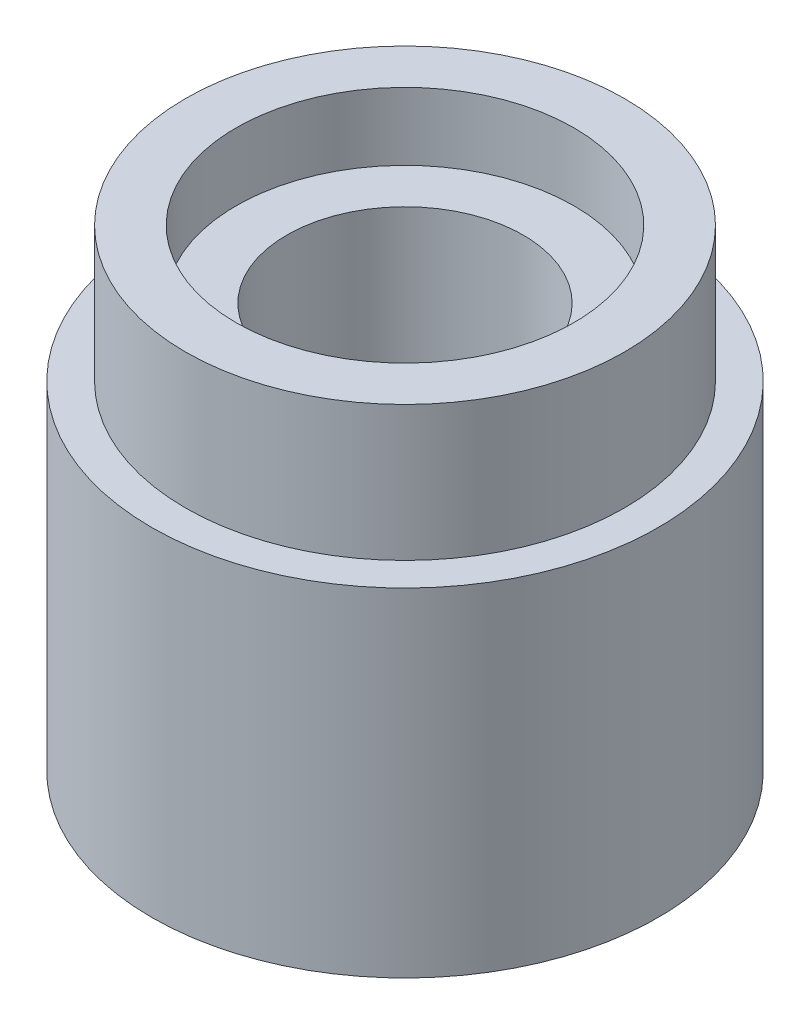
ISO-10303-21;
HEADER;
FILE_DESCRIPTION(('STEP AP214'),'2;1');
FILE_NAME('part.step','',(''),(''),'','','');
FILE_SCHEMA(('AUTOMOTIVE_DESIGN { 1 0 10303 214 1 1 1 1 }'));
ENDSEC;
DATA;
#1=APPLICATION_CONTEXT('core data for automotive mechanical design processes');
#2=APPLICATION_PROTOCOL_DEFINITION('international standard','automotive_design',2000,#1);
#3=PRODUCT_CONTEXT('',#1,'mechanical');
#4=PRODUCT('Part','Part','',(#3));
#5=PRODUCT_RELATED_PRODUCT_CATEGORY('part','',(#4));
#6=PRODUCT_DEFINITION_FORMATION('','',#4);
#7=PRODUCT_DEFINITION_CONTEXT('part definition',#1,'design');
#8=PRODUCT_DEFINITION('design','',#6,#7);
#9=PRODUCT_DEFINITION_SHAPE('','',#8);
#10=(LENGTH_UNIT() NAMED_UNIT(*) SI_UNIT(.MILLI.,.METRE.));
#11=(NAMED_UNIT(*) PLANE_ANGLE_UNIT() SI_UNIT($,.RADIAN.));
#12=(NAMED_UNIT(*) SI_UNIT($,.STERADIAN.) SOLID_ANGLE_UNIT());
#13=UNCERTAINTY_MEASURE_WITH_UNIT(LENGTH_MEASURE(1.E-05),#10,'distance_accuracy_value','');
#14=(GEOMETRIC_REPRESENTATION_CONTEXT(3) GLOBAL_UNCERTAINTY_ASSIGNED_CONTEXT((#13)) GLOBAL_UNIT_ASSIGNED_CONTEXT((#10,
#11,#12)) REPRESENTATION_CONTEXT('',''));
#15=CARTESIAN_POINT('',(0.,0.,0.));
#16=DIRECTION('',(0.,0.,1.));
#17=DIRECTION('',(1.,0.,0.));
#18=AXIS2_PLACEMENT_3D('',#15,#16,#17);
#19=CARTESIAN_POINT('',(0.,7.,0.));
#20=DIRECTION('',(0.,-1.,0.));
#21=DIRECTION('',(0.,0.,-1.));
#22=AXIS2_PLACEMENT_3D('',#19,#20,#21);
#23=CYLINDRICAL_SURFACE('',#22,3.75);
#24=CARTESIAN_POINT('',(0.,0.,0.));
#25=DIRECTION('',(0.,1.,0.));
#26=DIRECTION('',(0.,0.,1.));
#27=AXIS2_PLACEMENT_3D('',#24,#25,#26);
#28=CIRCLE('',#27,3.75);
#29=CARTESIAN_POINT('',(0.,0.,3.75));
#30=VERTEX_POINT('',#29);
#31=EDGE_CURVE('E10',#30,#30,#28,.T.);
#32=ORIENTED_EDGE('',*,*,#31,.T.);
#33=EDGE_LOOP('',(#32));
#34=FACE_BOUND('',#33,.T.);
#35=CARTESIAN_POINT('',(0.,5.,0.));
#36=DIRECTION('',(0.,1.,0.));
#37=DIRECTION('',(0.,0.,1.));
#38=AXIS2_PLACEMENT_3D('',#35,#36,#37);
#39=CIRCLE('',#38,3.75);
#40=CARTESIAN_POINT('',(0.,5.,3.75));
#41=VERTEX_POINT('',#40);
#42=EDGE_CURVE('E44',#41,#41,#39,.T.);
#43=ORIENTED_EDGE('',*,*,#42,.F.);
#44=EDGE_LOOP('',(#43));
#45=FACE_BOUND('',#44,.T.);
#46=ADVANCED_FACE('F36',(#34,#45),#23,.T.);
#47=CARTESIAN_POINT('',(0.,0.,0.));
#48=DIRECTION('',(0.,1.,0.));
#49=DIRECTION('',(0.,0.,1.));
#50=AXIS2_PLACEMENT_3D('',#47,#48,#49);
#51=PLANE('',#50);
#52=ORIENTED_EDGE('',*,*,#31,.F.);
#53=EDGE_LOOP('',(#52));
#54=FACE_BOUND('',#53,.T.);
#55=ADVANCED_FACE('F92',(#54),#51,.F.);
#56=CARTESIAN_POINT('',(0.,5.,0.));
#57=DIRECTION('',(0.,1.,0.));
#58=DIRECTION('',(0.,0.,1.));
#59=AXIS2_PLACEMENT_3D('',#56,#57,#58);
#60=PLANE('',#59);
#61=CARTESIAN_POINT('',(0.,5.,0.));
#62=DIRECTION('',(0.,1.,0.));
#63=DIRECTION('',(0.,0.,1.));
#64=AXIS2_PLACEMENT_3D('',#61,#62,#63);
#65=CIRCLE('',#64,3.25);
#66=CARTESIAN_POINT('',(0.,5.,3.25));
#67=VERTEX_POINT('',#66);
#68=EDGE_CURVE('E49',#67,#67,#65,.T.);
#69=ORIENTED_EDGE('',*,*,#68,.F.);
#70=EDGE_LOOP('',(#69));
#71=FACE_BOUND('',#70,.T.);
#72=ORIENTED_EDGE('',*,*,#42,.T.);
#73=EDGE_LOOP('',(#72));
#74=FACE_BOUND('',#73,.T.);
#75=ADVANCED_FACE('F96',(#71,#74),#60,.T.);
#76=CARTESIAN_POINT('',(0.,5.,0.));
#77=DIRECTION('',(0.,1.,0.));
#78=DIRECTION('',(0.,0.,1.));
#79=AXIS2_PLACEMENT_3D('',#76,#77,#78);
#80=CYLINDRICAL_SURFACE('',#79,3.25);
#81=ORIENTED_EDGE('',*,*,#68,.T.);
#82=EDGE_LOOP('',(#81));
#83=FACE_BOUND('',#82,.T.);
#84=CARTESIAN_POINT('',(0.,7.,0.));
#85=DIRECTION('',(0.,1.,0.));
#86=DIRECTION('',(0.,0.,1.));
#87=AXIS2_PLACEMENT_3D('',#84,#85,#86);
#88=CIRCLE('',#87,3.25);
#89=CARTESIAN_POINT('',(0.,7.,3.25));
#90=VERTEX_POINT('',#89);
#91=EDGE_CURVE('E52',#90,#90,#88,.T.);
#92=ORIENTED_EDGE('',*,*,#91,.F.);
#93=EDGE_LOOP('',(#92));
#94=FACE_BOUND('',#93,.T.);
#95=ADVANCED_FACE('F102',(#83,#94),#80,.T.);
#96=CARTESIAN_POINT('',(0.,7.,0.));
#97=DIRECTION('',(0.,1.,0.));
#98=DIRECTION('',(0.,0.,1.));
#99=AXIS2_PLACEMENT_3D('',#96,#97,#98);
#100=PLANE('',#99);
#101=CARTESIAN_POINT('',(0.,7.,0.));
#102=DIRECTION('',(0.,1.,0.));
#103=DIRECTION('',(0.,0.,1.));
#104=AXIS2_PLACEMENT_3D('',#101,#102,#103);
#105=CIRCLE('',#104,2.5);
#106=CARTESIAN_POINT('',(0.,7.,2.5));
#107=VERTEX_POINT('',#106);
#108=EDGE_CURVE('E63',#107,#107,#105,.T.);
#109=ORIENTED_EDGE('',*,*,#108,.F.);
#110=EDGE_LOOP('',(#109));
#111=FACE_BOUND('',#110,.T.);
#112=ORIENTED_EDGE('',*,*,#91,.T.);
#113=EDGE_LOOP('',(#112));
#114=FACE_BOUND('',#113,.T.);
#115=ADVANCED_FACE('F108',(#111,#114),#100,.T.);
#116=CARTESIAN_POINT('',(0.,6.,0.));
#117=DIRECTION('',(0.,1.,0.));
#118=DIRECTION('',(0.,0.,1.));
#119=AXIS2_PLACEMENT_3D('',#116,#117,#118);
#120=PLANE('',#119);
#121=CARTESIAN_POINT('',(0.,6.,0.));
#122=DIRECTION('',(0.,1.,0.));
#123=DIRECTION('',(0.,0.,1.));
#124=AXIS2_PLACEMENT_3D('',#121,#122,#123);
#125=CIRCLE('',#124,2.5);
#126=CARTESIAN_POINT('',(0.,6.,2.5));
#127=VERTEX_POINT('',#126);
#128=EDGE_CURVE('E67',#127,#127,#125,.T.);
#129=ORIENTED_EDGE('',*,*,#128,.T.);
#130=EDGE_LOOP('',(#129));
#131=FACE_BOUND('',#130,.T.);
#132=CARTESIAN_POINT('',(0.,6.,0.));
#133=DIRECTION('',(0.,1.,0.));
#134=DIRECTION('',(0.,0.,1.));
#135=AXIS2_PLACEMENT_3D('',#132,#133,#134);
#136=CIRCLE('',#135,1.75);
#137=CARTESIAN_POINT('',(0.,6.,1.75));
#138=VERTEX_POINT('',#137);
#139=EDGE_CURVE('E39',#138,#138,#136,.F.);
#140=ORIENTED_EDGE('',*,*,#139,.T.);
#141=EDGE_LOOP('',(#140));
#142=FACE_BOUND('',#141,.T.);
#143=ADVANCED_FACE('F76',(#131,#142),#120,.T.);
#144=CARTESIAN_POINT('',(0.,6.,0.));
#145=DIRECTION('',(0.,1.,0.));
#146=DIRECTION('',(0.,0.,1.));
#147=AXIS2_PLACEMENT_3D('',#144,#145,#146);
#148=CYLINDRICAL_SURFACE('',#147,2.5);
#149=ORIENTED_EDGE('',*,*,#128,.F.);
#150=EDGE_LOOP('',(#149));
#151=FACE_BOUND('',#150,.T.);
#152=ORIENTED_EDGE('',*,*,#108,.T.);
#153=EDGE_LOOP('',(#152));
#154=FACE_BOUND('',#153,.T.);
#155=ADVANCED_FACE('F86',(#151,#154),#148,.F.);
#156=CARTESIAN_POINT('',(0.,0.5,0.));
#157=DIRECTION('',(0.,1.,0.));
#158=DIRECTION('',(0.,0.,1.));
#159=AXIS2_PLACEMENT_3D('',#156,#157,#158);
#160=PLANE('',#159);
#161=CARTESIAN_POINT('',(0.,0.5,0.));
#162=DIRECTION('',(0.,1.,0.));
#163=DIRECTION('',(0.,0.,1.));
#164=AXIS2_PLACEMENT_3D('',#161,#162,#163);
#165=CIRCLE('',#164,1.75);
#166=CARTESIAN_POINT('',(0.,0.5,1.75));
#167=VERTEX_POINT('',#166);
#168=EDGE_CURVE('E56',#167,#167,#165,.T.);
#169=ORIENTED_EDGE('',*,*,#168,.T.);
#170=EDGE_LOOP('',(#169));
#171=FACE_BOUND('',#170,.T.);
#172=ADVANCED_FACE('F80',(#171),#160,.T.);
#173=CARTESIAN_POINT('',(0.,0.5,0.));
#174=DIRECTION('',(0.,1.,0.));
#175=DIRECTION('',(0.,0.,1.));
#176=AXIS2_PLACEMENT_3D('',#173,#174,#175);
#177=CYLINDRICAL_SURFACE('',#176,1.75);
#178=ORIENTED_EDGE('',*,*,#168,.F.);
#179=EDGE_LOOP('',(#178));
#180=FACE_BOUND('',#179,.T.);
#181=ORIENTED_EDGE('',*,*,#139,.F.);
#182=EDGE_LOOP('',(#181));
#183=FACE_BOUND('',#182,.T.);
#184=ADVANCED_FACE('F78',(#180,#183),#177,.F.);
#185=CLOSED_SHELL('',(#46,#55,#75,#95,#115,#143,#155,#172,#184));
#186=MANIFOLD_SOLID_BREP('B2',#185);
#187=ADVANCED_BREP_SHAPE_REPRESENTATION('',(#18,#186),#14);
#188=SHAPE_DEFINITION_REPRESENTATION(#9,#187);
ENDSEC;
END-ISO-10303-21;
